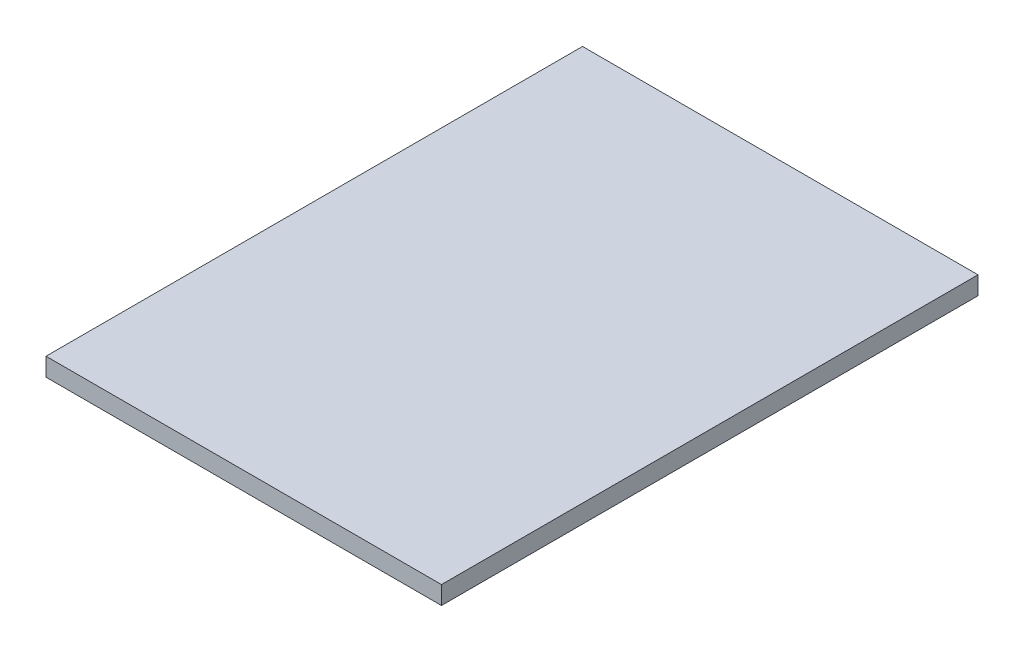
ISO-10303-21;
HEADER;
FILE_DESCRIPTION(('STEP AP214'),'2;1');
FILE_NAME('part.step','',(''),(''),'','','');
FILE_SCHEMA(('AUTOMOTIVE_DESIGN { 1 0 10303 214 1 1 1 1 }'));
ENDSEC;
DATA;
#1=APPLICATION_CONTEXT('core data for automotive mechanical design processes');
#2=APPLICATION_PROTOCOL_DEFINITION('international standard','automotive_design',2000,#1);
#3=PRODUCT_CONTEXT('',#1,'mechanical');
#4=PRODUCT('Part','Part','',(#3));
#5=PRODUCT_RELATED_PRODUCT_CATEGORY('part','',(#4));
#6=PRODUCT_DEFINITION_FORMATION('','',#4);
#7=PRODUCT_DEFINITION_CONTEXT('part definition',#1,'design');
#8=PRODUCT_DEFINITION('design','',#6,#7);
#9=PRODUCT_DEFINITION_SHAPE('','',#8);
#10=(LENGTH_UNIT() NAMED_UNIT(*) SI_UNIT(.MILLI.,.METRE.));
#11=(NAMED_UNIT(*) PLANE_ANGLE_UNIT() SI_UNIT($,.RADIAN.));
#12=(NAMED_UNIT(*) SI_UNIT($,.STERADIAN.) SOLID_ANGLE_UNIT());
#13=UNCERTAINTY_MEASURE_WITH_UNIT(LENGTH_MEASURE(1.E-05),#10,'distance_accuracy_value','');
#14=(GEOMETRIC_REPRESENTATION_CONTEXT(3) GLOBAL_UNCERTAINTY_ASSIGNED_CONTEXT((#13)) GLOBAL_UNIT_ASSIGNED_CONTEXT((#10,
#11,#12)) REPRESENTATION_CONTEXT('',''));
#15=CARTESIAN_POINT('',(0.,0.,0.));
#16=DIRECTION('',(0.,0.,1.));
#17=DIRECTION('',(1.,0.,0.));
#18=AXIS2_PLACEMENT_3D('',#15,#16,#17);
#19=CARTESIAN_POINT('',(32.6340918454056,3.,44.2720685017724));
#20=DIRECTION('',(-1.,0.,0.));
#21=DIRECTION('',(0.,0.,1.));
#22=AXIS2_PLACEMENT_3D('',#19,#20,#21);
#23=PLANE('',#22);
#24=DIRECTION('',(0.,0.,-1.));
#25=VECTOR('',#24,1.);
#26=CARTESIAN_POINT('',(32.6340918454056,0.,44.2720685017724));
#27=LINE('',#26,#25);
#28=CARTESIAN_POINT('',(32.6340918454056,0.,44.2720685017724));
#29=VERTEX_POINT('',#28);
#30=CARTESIAN_POINT('',(32.6340918454056,0.,-44.2720685017724));
#31=VERTEX_POINT('',#30);
#32=EDGE_CURVE('E96',#29,#31,#27,.T.);
#33=ORIENTED_EDGE('',*,*,#32,.T.);
#34=DIRECTION('',(0.,-1.,0.));
#35=VECTOR('',#34,1.);
#36=CARTESIAN_POINT('',(32.6340918454056,3.,-44.2720685017724));
#37=LINE('',#36,#35);
#38=CARTESIAN_POINT('',(32.6340918454056,3.,-44.2720685017724));
#39=VERTEX_POINT('',#38);
#40=EDGE_CURVE('E11',#39,#31,#37,.T.);
#41=ORIENTED_EDGE('',*,*,#40,.F.);
#42=DIRECTION('',(0.,0.,-1.));
#43=VECTOR('',#42,1.);
#44=CARTESIAN_POINT('',(32.6340918454056,3.,44.2720685017724));
#45=LINE('',#44,#43);
#46=CARTESIAN_POINT('',(32.6340918454056,3.,44.2720685017724));
#47=VERTEX_POINT('',#46);
#48=EDGE_CURVE('E84',#47,#39,#45,.T.);
#49=ORIENTED_EDGE('',*,*,#48,.F.);
#50=DIRECTION('',(0.,-1.,0.));
#51=VECTOR('',#50,1.);
#52=CARTESIAN_POINT('',(32.6340918454056,3.,44.2720685017724));
#53=LINE('',#52,#51);
#54=EDGE_CURVE('E92',#47,#29,#53,.T.);
#55=ORIENTED_EDGE('',*,*,#54,.T.);
#56=EDGE_LOOP('',(#33,#41,#49,#55));
#57=FACE_BOUND('',#56,.T.);
#58=ADVANCED_FACE('F33',(#57),#23,.F.);
#59=CARTESIAN_POINT('',(-32.6340918454056,3.,-44.2720685017724));
#60=DIRECTION('',(0.,0.,1.));
#61=DIRECTION('',(1.,0.,0.));
#62=AXIS2_PLACEMENT_3D('',#59,#60,#61);
#63=PLANE('',#62);
#64=DIRECTION('',(-1.,0.,0.));
#65=VECTOR('',#64,1.);
#66=CARTESIAN_POINT('',(-32.6340918454056,0.,-44.2720685017724));
#67=LINE('',#66,#65);
#68=CARTESIAN_POINT('',(-32.6340918454056,0.,-44.2720685017724));
#69=VERTEX_POINT('',#68);
#70=EDGE_CURVE('E88',#31,#69,#67,.T.);
#71=ORIENTED_EDGE('',*,*,#70,.T.);
#72=DIRECTION('',(0.,-1.,0.));
#73=VECTOR('',#72,1.);
#74=CARTESIAN_POINT('',(-32.6340918454056,3.,-44.2720685017724));
#75=LINE('',#74,#73);
#76=CARTESIAN_POINT('',(-32.6340918454056,3.,-44.2720685017724));
#77=VERTEX_POINT('',#76);
#78=EDGE_CURVE('E41',#77,#69,#75,.T.);
#79=ORIENTED_EDGE('',*,*,#78,.F.);
#80=DIRECTION('',(-1.,0.,0.));
#81=VECTOR('',#80,1.);
#82=CARTESIAN_POINT('',(-32.6340918454056,3.,-44.2720685017724));
#83=LINE('',#82,#81);
#84=EDGE_CURVE('E79',#39,#77,#83,.T.);
#85=ORIENTED_EDGE('',*,*,#84,.F.);
#86=ORIENTED_EDGE('',*,*,#40,.T.);
#87=EDGE_LOOP('',(#71,#79,#85,#86));
#88=FACE_BOUND('',#87,.T.);
#89=ADVANCED_FACE('F87',(#88),#63,.F.);
#90=CARTESIAN_POINT('',(-32.6340918454056,3.,44.2720685017724));
#91=DIRECTION('',(1.,0.,0.));
#92=DIRECTION('',(0.,0.,-1.));
#93=AXIS2_PLACEMENT_3D('',#90,#91,#92);
#94=PLANE('',#93);
#95=DIRECTION('',(0.,0.,1.));
#96=VECTOR('',#95,1.);
#97=CARTESIAN_POINT('',(-32.6340918454056,0.,44.2720685017724));
#98=LINE('',#97,#96);
#99=CARTESIAN_POINT('',(-32.6340918454056,0.,44.2720685017724));
#100=VERTEX_POINT('',#99);
#101=EDGE_CURVE('E66',#69,#100,#98,.T.);
#102=ORIENTED_EDGE('',*,*,#101,.T.);
#103=DIRECTION('',(0.,-1.,0.));
#104=VECTOR('',#103,1.);
#105=CARTESIAN_POINT('',(-32.6340918454056,3.,44.2720685017724));
#106=LINE('',#105,#104);
#107=CARTESIAN_POINT('',(-32.6340918454056,3.,44.2720685017724));
#108=VERTEX_POINT('',#107);
#109=EDGE_CURVE('E89',#108,#100,#106,.T.);
#110=ORIENTED_EDGE('',*,*,#109,.F.);
#111=DIRECTION('',(0.,0.,1.));
#112=VECTOR('',#111,1.);
#113=CARTESIAN_POINT('',(-32.6340918454056,3.,44.2720685017724));
#114=LINE('',#113,#112);
#115=EDGE_CURVE('E82',#77,#108,#114,.T.);
#116=ORIENTED_EDGE('',*,*,#115,.F.);
#117=ORIENTED_EDGE('',*,*,#78,.T.);
#118=EDGE_LOOP('',(#102,#110,#116,#117));
#119=FACE_BOUND('',#118,.T.);
#120=ADVANCED_FACE('F90',(#119),#94,.F.);
#121=CARTESIAN_POINT('',(-32.6340918454056,3.,44.2720685017724));
#122=DIRECTION('',(0.,0.,-1.));
#123=DIRECTION('',(-1.,0.,0.));
#124=AXIS2_PLACEMENT_3D('',#121,#122,#123);
#125=PLANE('',#124);
#126=DIRECTION('',(1.,0.,0.));
#127=VECTOR('',#126,1.);
#128=CARTESIAN_POINT('',(-32.6340918454056,0.,44.2720685017724));
#129=LINE('',#128,#127);
#130=EDGE_CURVE('E72',#100,#29,#129,.T.);
#131=ORIENTED_EDGE('',*,*,#130,.T.);
#132=ORIENTED_EDGE('',*,*,#54,.F.);
#133=DIRECTION('',(1.,0.,0.));
#134=VECTOR('',#133,1.);
#135=CARTESIAN_POINT('',(-32.6340918454056,3.,44.2720685017724));
#136=LINE('',#135,#134);
#137=EDGE_CURVE('E49',#108,#47,#136,.T.);
#138=ORIENTED_EDGE('',*,*,#137,.F.);
#139=ORIENTED_EDGE('',*,*,#109,.T.);
#140=EDGE_LOOP('',(#131,#132,#138,#139));
#141=FACE_BOUND('',#140,.T.);
#142=ADVANCED_FACE('F103',(#141),#125,.F.);
#143=CARTESIAN_POINT('',(0.,3.,0.));
#144=DIRECTION('',(0.,-1.,0.));
#145=DIRECTION('',(0.,0.,-1.));
#146=AXIS2_PLACEMENT_3D('',#143,#144,#145);
#147=PLANE('',#146);
#148=ORIENTED_EDGE('',*,*,#48,.T.);
#149=ORIENTED_EDGE('',*,*,#84,.T.);
#150=ORIENTED_EDGE('',*,*,#115,.T.);
#151=ORIENTED_EDGE('',*,*,#137,.T.);
#152=EDGE_LOOP('',(#148,#149,#150,#151));
#153=FACE_BOUND('',#152,.T.);
#154=ADVANCED_FACE('F80',(#153),#147,.F.);
#155=CARTESIAN_POINT('',(0.,0.,0.));
#156=DIRECTION('',(0.,-1.,0.));
#157=DIRECTION('',(0.,0.,-1.));
#158=AXIS2_PLACEMENT_3D('',#155,#156,#157);
#159=PLANE('',#158);
#160=ORIENTED_EDGE('',*,*,#32,.F.);
#161=ORIENTED_EDGE('',*,*,#130,.F.);
#162=ORIENTED_EDGE('',*,*,#101,.F.);
#163=ORIENTED_EDGE('',*,*,#70,.F.);
#164=EDGE_LOOP('',(#160,#161,#162,#163));
#165=FACE_BOUND('',#164,.T.);
#166=ADVANCED_FACE('F106',(#165),#159,.T.);
#167=CLOSED_SHELL('',(#58,#89,#120,#142,#154,#166));
#168=MANIFOLD_SOLID_BREP('B2',#167);
#169=ADVANCED_BREP_SHAPE_REPRESENTATION('',(#18,#168),#14);
#170=SHAPE_DEFINITION_REPRESENTATION(#9,#169);
ENDSEC;
END-ISO-10303-21;
